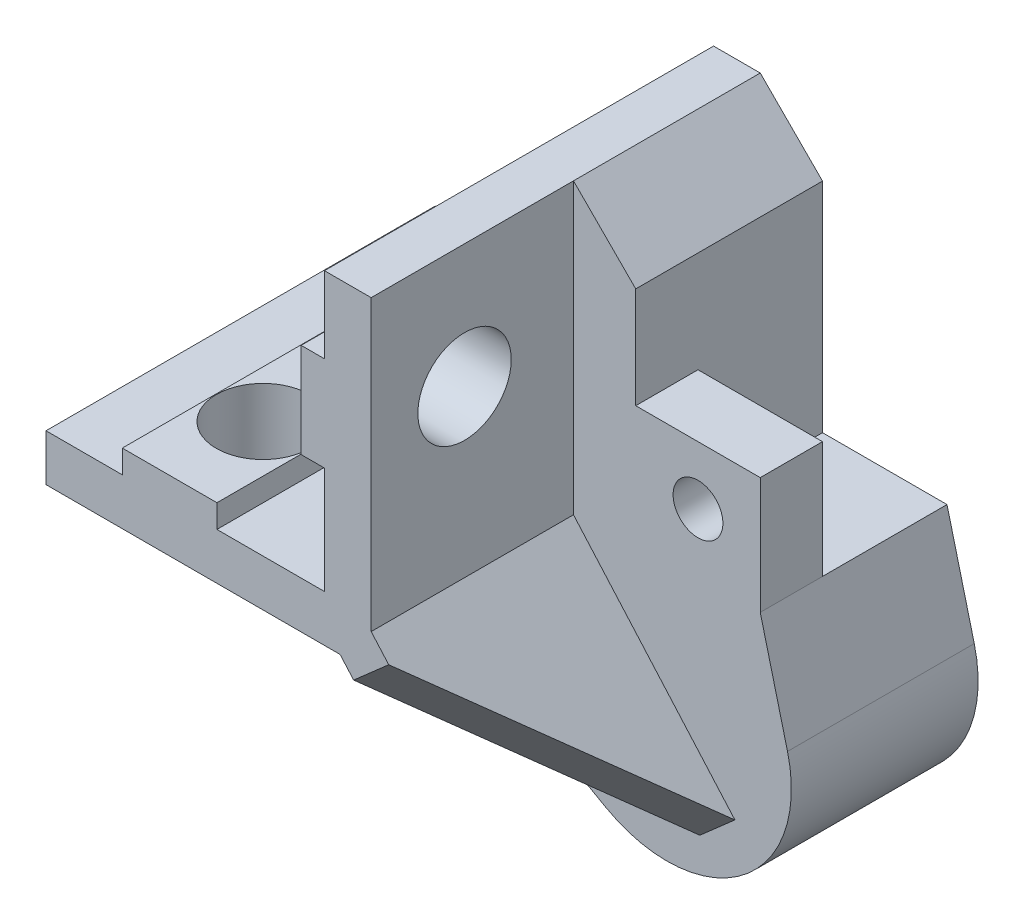
ISO-10303-21;
HEADER;
FILE_DESCRIPTION(('STEP AP214'),'2;1');
FILE_NAME('part.step','',(''),(''),'','','');
FILE_SCHEMA(('AUTOMOTIVE_DESIGN { 1 0 10303 214 1 1 1 1 }'));
ENDSEC;
DATA;
#1=APPLICATION_CONTEXT('core data for automotive mechanical design processes');
#2=APPLICATION_PROTOCOL_DEFINITION('international standard','automotive_design',2000,#1);
#3=PRODUCT_CONTEXT('',#1,'mechanical');
#4=PRODUCT('Part','Part','',(#3));
#5=PRODUCT_RELATED_PRODUCT_CATEGORY('part','',(#4));
#6=PRODUCT_DEFINITION_FORMATION('','',#4);
#7=PRODUCT_DEFINITION_CONTEXT('part definition',#1,'design');
#8=PRODUCT_DEFINITION('design','',#6,#7);
#9=PRODUCT_DEFINITION_SHAPE('','',#8);
#10=(LENGTH_UNIT() NAMED_UNIT(*) SI_UNIT(.MILLI.,.METRE.));
#11=(NAMED_UNIT(*) PLANE_ANGLE_UNIT() SI_UNIT($,.RADIAN.));
#12=(NAMED_UNIT(*) SI_UNIT($,.STERADIAN.) SOLID_ANGLE_UNIT());
#13=UNCERTAINTY_MEASURE_WITH_UNIT(LENGTH_MEASURE(1.E-05),#10,'distance_accuracy_value','');
#14=(GEOMETRIC_REPRESENTATION_CONTEXT(3) GLOBAL_UNCERTAINTY_ASSIGNED_CONTEXT((#13)) GLOBAL_UNIT_ASSIGNED_CONTEXT((#10,
#11,#12)) REPRESENTATION_CONTEXT('',''));
#15=CARTESIAN_POINT('',(0.,0.,0.));
#16=DIRECTION('',(0.,0.,1.));
#17=DIRECTION('',(1.,0.,0.));
#18=AXIS2_PLACEMENT_3D('',#15,#16,#17);
#19=CARTESIAN_POINT('',(234.088719843331,44.2696097209728,-13.));
#20=DIRECTION('',(0.,1.,0.));
#21=DIRECTION('',(0.,0.,1.));
#22=AXIS2_PLACEMENT_3D('',#19,#20,#21);
#23=PLANE('',#22);
#24=DIRECTION('',(0.,0.,-1.));
#25=VECTOR('',#24,1.);
#26=CARTESIAN_POINT('',(234.088719843331,44.2696097209728,-13.));
#27=LINE('',#26,#25);
#28=CARTESIAN_POINT('',(234.088719843331,44.2696097209728,-17.));
#29=VERTEX_POINT('',#28);
#30=CARTESIAN_POINT('',(234.088719843331,44.2696097209728,-25.));
#31=VERTEX_POINT('',#30);
#32=EDGE_CURVE('E308',#29,#31,#27,.T.);
#33=ORIENTED_EDGE('',*,*,#32,.F.);
#34=DIRECTION('',(1.,0.,0.));
#35=VECTOR('',#34,1.);
#36=CARTESIAN_POINT('',(242.088719843331,44.2696097209728,-17.));
#37=LINE('',#36,#35);
#38=CARTESIAN_POINT('',(242.088719843331,44.2696097209728,-17.));
#39=VERTEX_POINT('',#38);
#40=EDGE_CURVE('E47',#29,#39,#37,.T.);
#41=ORIENTED_EDGE('',*,*,#40,.T.);
#42=DIRECTION('',(0.,0.,-1.));
#43=VECTOR('',#42,1.);
#44=CARTESIAN_POINT('',(242.088719843331,44.2696097209728,-13.));
#45=LINE('',#44,#43);
#46=CARTESIAN_POINT('',(242.088719843331,44.2696097209728,-25.));
#47=VERTEX_POINT('',#46);
#48=EDGE_CURVE('E307',#39,#47,#45,.T.);
#49=ORIENTED_EDGE('',*,*,#48,.T.);
#50=DIRECTION('',(1.,0.,0.));
#51=VECTOR('',#50,1.);
#52=CARTESIAN_POINT('',(234.088719843331,44.2696097209728,-25.));
#53=LINE('',#52,#51);
#54=EDGE_CURVE('E290',#31,#47,#53,.T.);
#55=ORIENTED_EDGE('',*,*,#54,.F.);
#56=EDGE_LOOP('',(#33,#41,#49,#55));
#57=FACE_BOUND('',#56,.T.);
#58=ADVANCED_FACE('F32',(#57),#23,.T.);
#59=CARTESIAN_POINT('',(230.088719843331,41.429550862018,-25.));
#60=DIRECTION('',(1.,0.,0.));
#61=DIRECTION('',(0.,0.,-1.));
#62=AXIS2_PLACEMENT_3D('',#59,#60,#61);
#63=PLANE('',#62);
#64=CARTESIAN_POINT('',(230.088719843331,54.3395711724228,-6.));
#65=DIRECTION('',(1.,0.,0.));
#66=DIRECTION('',(0.,0.,-1.));
#67=AXIS2_PLACEMENT_3D('',#64,#65,#66);
#68=CIRCLE('',#67,3.);
#69=CARTESIAN_POINT('',(230.088719843331,54.3395711724228,-9.));
#70=VERTEX_POINT('',#69);
#71=EDGE_CURVE('E314',#70,#70,#68,.T.);
#72=ORIENTED_EDGE('',*,*,#71,.F.);
#73=EDGE_LOOP('',(#72));
#74=FACE_BOUND('',#73,.T.);
#75=DIRECTION('',(0.,1.,0.));
#76=VECTOR('',#75,1.);
#77=CARTESIAN_POINT('',(230.088719843331,41.429550862018,0.));
#78=LINE('',#77,#76);
#79=CARTESIAN_POINT('',(230.088719843331,43.7010200375261,0.));
#80=VERTEX_POINT('',#79);
#81=CARTESIAN_POINT('',(230.088719843331,62.2829711724228,0.));
#82=VERTEX_POINT('',#81);
#83=EDGE_CURVE('E322',#80,#82,#78,.T.);
#84=ORIENTED_EDGE('',*,*,#83,.F.);
#85=DIRECTION('',(0.,0.,-1.));
#86=VECTOR('',#85,1.);
#87=CARTESIAN_POINT('',(230.088719843331,43.7010200375261,-25.));
#88=LINE('',#87,#86);
#89=CARTESIAN_POINT('',(230.088719843331,43.7010200375261,-13.));
#90=VERTEX_POINT('',#89);
#91=EDGE_CURVE('E257',#80,#90,#88,.T.);
#92=ORIENTED_EDGE('',*,*,#91,.T.);
#93=DIRECTION('',(0.,1.,0.));
#94=VECTOR('',#93,1.);
#95=CARTESIAN_POINT('',(230.088719843331,41.429550862018,-13.));
#96=LINE('',#95,#94);
#97=CARTESIAN_POINT('',(230.088719843331,62.2829711724228,-13.));
#98=VERTEX_POINT('',#97);
#99=EDGE_CURVE('E264',#90,#98,#96,.T.);
#100=ORIENTED_EDGE('',*,*,#99,.T.);
#101=DIRECTION('',(0.,0.,1.));
#102=VECTOR('',#101,1.);
#103=CARTESIAN_POINT('',(230.088719843331,62.2829711724228,-25.));
#104=LINE('',#103,#102);
#105=EDGE_CURVE('E398',#98,#82,#104,.T.);
#106=ORIENTED_EDGE('',*,*,#105,.T.);
#107=EDGE_LOOP('',(#84,#92,#100,#106));
#108=FACE_BOUND('',#107,.T.);
#109=ADVANCED_FACE('F483',(#74,#108),#63,.T.);
#110=CARTESIAN_POINT('',(209.195275179556,41.429550862018,-25.));
#111=DIRECTION('',(0.,-1.,0.));
#112=DIRECTION('',(0.,0.,-1.));
#113=AXIS2_PLACEMENT_3D('',#110,#111,#112);
#114=PLANE('',#113);
#115=DIRECTION('',(0.,0.,-1.));
#116=VECTOR('',#115,1.);
#117=CARTESIAN_POINT('',(228.091234798935,41.429550862018,-25.));
#118=LINE('',#117,#116);
#119=CARTESIAN_POINT('',(228.091234798935,41.429550862018,0.));
#120=VERTEX_POINT('',#119);
#121=CARTESIAN_POINT('',(228.091234798935,41.429550862018,-13.));
#122=VERTEX_POINT('',#121);
#123=EDGE_CURVE('E260',#120,#122,#118,.T.);
#124=ORIENTED_EDGE('',*,*,#123,.F.);
#125=DIRECTION('',(1.,0.,0.));
#126=VECTOR('',#125,1.);
#127=CARTESIAN_POINT('',(209.195275179556,41.429550862018,0.));
#128=LINE('',#127,#126);
#129=CARTESIAN_POINT('',(209.195275179556,41.429550862018,0.));
#130=VERTEX_POINT('',#129);
#131=EDGE_CURVE('E391',#130,#120,#128,.T.);
#132=ORIENTED_EDGE('',*,*,#131,.F.);
#133=DIRECTION('',(0.,0.,1.));
#134=VECTOR('',#133,1.);
#135=CARTESIAN_POINT('',(209.195275179556,41.429550862018,-25.));
#136=LINE('',#135,#134);
#137=CARTESIAN_POINT('',(209.195275179556,41.429550862018,-13.));
#138=VERTEX_POINT('',#137);
#139=EDGE_CURVE('E402',#138,#130,#136,.T.);
#140=ORIENTED_EDGE('',*,*,#139,.F.);
#141=DIRECTION('',(1.,0.,0.));
#142=VECTOR('',#141,1.);
#143=CARTESIAN_POINT('',(209.195275179556,41.429550862018,-13.));
#144=LINE('',#143,#142);
#145=EDGE_CURVE('E281',#138,#122,#144,.T.);
#146=ORIENTED_EDGE('',*,*,#145,.T.);
#147=EDGE_LOOP('',(#124,#132,#140,#146));
#148=FACE_BOUND('',#147,.T.);
#149=CARTESIAN_POINT('',(217.138695007103,41.429550862018,-6.));
#150=DIRECTION('',(0.,-1.,0.));
#151=DIRECTION('',(0.,0.,-1.));
#152=AXIS2_PLACEMENT_3D('',#149,#150,#151);
#153=CIRCLE('',#152,2.99999999999999);
#154=CARTESIAN_POINT('',(217.138695007103,41.429550862018,-8.99999999999999));
#155=VERTEX_POINT('',#154);
#156=EDGE_CURVE('E303',#155,#155,#153,.T.);
#157=ORIENTED_EDGE('',*,*,#156,.F.);
#158=EDGE_LOOP('',(#157));
#159=FACE_BOUND('',#158,.T.);
#160=ADVANCED_FACE('F449',(#148,#159),#114,.T.);
#161=CARTESIAN_POINT('',(230.088719843331,62.2829711724228,-25.));
#162=DIRECTION('',(0.,1.,0.));
#163=DIRECTION('',(-1.,0.,0.));
#164=AXIS2_PLACEMENT_3D('',#161,#162,#163);
#165=PLANE('',#164);
#166=DIRECTION('',(-1.,0.,0.));
#167=VECTOR('',#166,1.);
#168=CARTESIAN_POINT('',(230.088719843331,62.2829711724228,0.));
#169=LINE('',#168,#167);
#170=CARTESIAN_POINT('',(227.088719843331,62.2829711724228,0.));
#171=VERTEX_POINT('',#170);
#172=EDGE_CURVE('E355',#82,#171,#169,.T.);
#173=ORIENTED_EDGE('',*,*,#172,.F.);
#174=ORIENTED_EDGE('',*,*,#105,.F.);
#175=CARTESIAN_POINT('',(230.088719843331,62.2829711724228,-25.));
#176=VERTEX_POINT('',#175);
#177=EDGE_CURVE('E395',#176,#98,#104,.T.);
#178=ORIENTED_EDGE('',*,*,#177,.F.);
#179=DIRECTION('',(-1.,0.,0.));
#180=VECTOR('',#179,1.);
#181=CARTESIAN_POINT('',(230.088719843331,62.2829711724228,-25.));
#182=LINE('',#181,#180);
#183=CARTESIAN_POINT('',(227.088719843331,62.2829711724228,-25.));
#184=VERTEX_POINT('',#183);
#185=EDGE_CURVE('E318',#176,#184,#182,.T.);
#186=ORIENTED_EDGE('',*,*,#185,.T.);
#187=DIRECTION('',(0.,0.,1.));
#188=VECTOR('',#187,1.);
#189=CARTESIAN_POINT('',(227.088719843331,62.2829711724228,-25.));
#190=LINE('',#189,#188);
#191=EDGE_CURVE('E354',#184,#171,#190,.T.);
#192=ORIENTED_EDGE('',*,*,#191,.T.);
#193=EDGE_LOOP('',(#173,#174,#178,#186,#192));
#194=FACE_BOUND('',#193,.T.);
#195=ADVANCED_FACE('F34',(#194),#165,.T.);
#196=CARTESIAN_POINT('',(209.195275179556,44.429550862018,-25.));
#197=DIRECTION('',(-1.,0.,0.));
#198=DIRECTION('',(0.,-1.,0.));
#199=AXIS2_PLACEMENT_3D('',#196,#197,#198);
#200=PLANE('',#199);
#201=DIRECTION('',(0.,-1.,0.));
#202=VECTOR('',#201,1.);
#203=CARTESIAN_POINT('',(209.195275179556,44.429550862018,0.));
#204=LINE('',#203,#202);
#205=CARTESIAN_POINT('',(209.195275179556,44.429550862018,0.));
#206=VERTEX_POINT('',#205);
#207=EDGE_CURVE('E388',#206,#130,#204,.T.);
#208=ORIENTED_EDGE('',*,*,#207,.F.);
#209=DIRECTION('',(0.,0.,1.));
#210=VECTOR('',#209,1.);
#211=CARTESIAN_POINT('',(209.195275179556,44.429550862018,-25.));
#212=LINE('',#211,#210);
#213=CARTESIAN_POINT('',(209.195275179556,44.429550862018,-25.));
#214=VERTEX_POINT('',#213);
#215=EDGE_CURVE('E403',#214,#206,#212,.T.);
#216=ORIENTED_EDGE('',*,*,#215,.F.);
#217=DIRECTION('',(0.,-1.,0.));
#218=VECTOR('',#217,1.);
#219=CARTESIAN_POINT('',(209.195275179556,44.429550862018,-25.));
#220=LINE('',#219,#218);
#221=CARTESIAN_POINT('',(209.195275179556,41.429550862018,-25.));
#222=VERTEX_POINT('',#221);
#223=EDGE_CURVE('E352',#214,#222,#220,.T.);
#224=ORIENTED_EDGE('',*,*,#223,.T.);
#225=EDGE_CURVE('E399',#222,#138,#136,.T.);
#226=ORIENTED_EDGE('',*,*,#225,.T.);
#227=ORIENTED_EDGE('',*,*,#139,.T.);
#228=EDGE_LOOP('',(#208,#216,#224,#226,#227));
#229=FACE_BOUND('',#228,.T.);
#230=ADVANCED_FACE('F497',(#229),#200,.T.);
#231=CARTESIAN_POINT('',(214.098687418949,44.429550862018,-25.));
#232=DIRECTION('',(0.,1.,0.));
#233=DIRECTION('',(-1.,0.,0.));
#234=AXIS2_PLACEMENT_3D('',#231,#232,#233);
#235=PLANE('',#234);
#236=DIRECTION('',(-1.,0.,0.));
#237=VECTOR('',#236,1.);
#238=CARTESIAN_POINT('',(214.098687418949,44.429550862018,0.));
#239=LINE('',#238,#237);
#240=CARTESIAN_POINT('',(214.098687418949,44.429550862018,0.));
#241=VERTEX_POINT('',#240);
#242=EDGE_CURVE('E385',#241,#206,#239,.T.);
#243=ORIENTED_EDGE('',*,*,#242,.F.);
#244=DIRECTION('',(0.,0.,1.));
#245=VECTOR('',#244,1.);
#246=CARTESIAN_POINT('',(214.098687418949,44.429550862018,-25.));
#247=LINE('',#246,#245);
#248=CARTESIAN_POINT('',(214.098687418949,44.429550862018,-25.));
#249=VERTEX_POINT('',#248);
#250=EDGE_CURVE('E405',#249,#241,#247,.T.);
#251=ORIENTED_EDGE('',*,*,#250,.F.);
#252=DIRECTION('',(-1.,0.,0.));
#253=VECTOR('',#252,1.);
#254=CARTESIAN_POINT('',(214.098687418949,44.429550862018,-25.));
#255=LINE('',#254,#253);
#256=EDGE_CURVE('E349',#249,#214,#255,.T.);
#257=ORIENTED_EDGE('',*,*,#256,.T.);
#258=ORIENTED_EDGE('',*,*,#215,.T.);
#259=EDGE_LOOP('',(#243,#251,#257,#258));
#260=FACE_BOUND('',#259,.T.);
#261=ADVANCED_FACE('F500',(#260),#235,.T.);
#262=CARTESIAN_POINT('',(214.098687418949,45.9171950677049,-25.));
#263=DIRECTION('',(-1.,0.,0.));
#264=DIRECTION('',(0.,0.,1.));
#265=AXIS2_PLACEMENT_3D('',#262,#263,#264);
#266=PLANE('',#265);
#267=DIRECTION('',(0.,-1.,0.));
#268=VECTOR('',#267,1.);
#269=CARTESIAN_POINT('',(214.098687418949,45.9171950677049,0.));
#270=LINE('',#269,#268);
#271=CARTESIAN_POINT('',(214.098687418949,45.9171950677049,0.));
#272=VERTEX_POINT('',#271);
#273=EDGE_CURVE('E382',#272,#241,#270,.T.);
#274=ORIENTED_EDGE('',*,*,#273,.F.);
#275=DIRECTION('',(0.,0.,1.));
#276=VECTOR('',#275,1.);
#277=CARTESIAN_POINT('',(214.098687418949,45.9171950677049,-25.));
#278=LINE('',#277,#276);
#279=CARTESIAN_POINT('',(214.098687418949,45.9171950677049,-25.));
#280=VERTEX_POINT('',#279);
#281=EDGE_CURVE('E407',#280,#272,#278,.T.);
#282=ORIENTED_EDGE('',*,*,#281,.F.);
#283=DIRECTION('',(0.,-1.,0.));
#284=VECTOR('',#283,1.);
#285=CARTESIAN_POINT('',(214.098687418949,45.9171950677049,-25.));
#286=LINE('',#285,#284);
#287=EDGE_CURVE('E346',#280,#249,#286,.T.);
#288=ORIENTED_EDGE('',*,*,#287,.T.);
#289=ORIENTED_EDGE('',*,*,#250,.T.);
#290=EDGE_LOOP('',(#274,#282,#288,#289));
#291=FACE_BOUND('',#290,.T.);
#292=ADVANCED_FACE('F504',(#291),#266,.T.);
#293=CARTESIAN_POINT('',(220.178702595257,45.9171950677049,-25.));
#294=DIRECTION('',(0.,1.,0.));
#295=DIRECTION('',(0.,0.,1.));
#296=AXIS2_PLACEMENT_3D('',#293,#294,#295);
#297=PLANE('',#296);
#298=CARTESIAN_POINT('',(217.138695007103,45.9171950677049,-6.));
#299=DIRECTION('',(0.,1.,0.));
#300=DIRECTION('',(0.,0.,1.));
#301=AXIS2_PLACEMENT_3D('',#298,#299,#300);
#302=CIRCLE('',#301,2.99999999999999);
#303=CARTESIAN_POINT('',(217.138695007103,45.9171950677049,-3.00000000000001));
#304=VERTEX_POINT('',#303);
#305=EDGE_CURVE('E313',#304,#304,#302,.T.);
#306=ORIENTED_EDGE('',*,*,#305,.F.);
#307=EDGE_LOOP('',(#306));
#308=FACE_BOUND('',#307,.T.);
#309=DIRECTION('',(-1.,0.,0.));
#310=VECTOR('',#309,1.);
#311=CARTESIAN_POINT('',(220.178702595257,45.9171950677049,0.));
#312=LINE('',#311,#310);
#313=CARTESIAN_POINT('',(220.178702595257,45.9171950677049,0.));
#314=VERTEX_POINT('',#313);
#315=EDGE_CURVE('E379',#314,#272,#312,.T.);
#316=ORIENTED_EDGE('',*,*,#315,.F.);
#317=DIRECTION('',(0.,0.,1.));
#318=VECTOR('',#317,1.);
#319=CARTESIAN_POINT('',(220.178702595257,45.9171950677049,-25.));
#320=LINE('',#319,#318);
#321=CARTESIAN_POINT('',(220.178702595257,45.9171950677049,-25.));
#322=VERTEX_POINT('',#321);
#323=EDGE_CURVE('E409',#322,#314,#320,.T.);
#324=ORIENTED_EDGE('',*,*,#323,.F.);
#325=DIRECTION('',(-1.,0.,0.));
#326=VECTOR('',#325,1.);
#327=CARTESIAN_POINT('',(220.178702595257,45.9171950677049,-25.));
#328=LINE('',#327,#326);
#329=EDGE_CURVE('E343',#322,#280,#328,.T.);
#330=ORIENTED_EDGE('',*,*,#329,.T.);
#331=ORIENTED_EDGE('',*,*,#281,.T.);
#332=EDGE_LOOP('',(#316,#324,#330,#331));
#333=FACE_BOUND('',#332,.T.);
#334=ADVANCED_FACE('F508',(#308,#333),#297,.T.);
#335=CARTESIAN_POINT('',(220.178702595257,45.9171950677049,-25.));
#336=DIRECTION('',(1.,0.,0.));
#337=DIRECTION('',(0.,1.,0.));
#338=AXIS2_PLACEMENT_3D('',#335,#336,#337);
#339=PLANE('',#338);
#340=DIRECTION('',(0.,1.,0.));
#341=VECTOR('',#340,1.);
#342=CARTESIAN_POINT('',(220.178702595257,45.9171950677049,0.));
#343=LINE('',#342,#341);
#344=CARTESIAN_POINT('',(220.178702595257,44.429550862018,0.));
#345=VERTEX_POINT('',#344);
#346=EDGE_CURVE('E376',#345,#314,#343,.T.);
#347=ORIENTED_EDGE('',*,*,#346,.F.);
#348=DIRECTION('',(0.,0.,1.));
#349=VECTOR('',#348,1.);
#350=CARTESIAN_POINT('',(220.178702595257,44.429550862018,-25.));
#351=LINE('',#350,#349);
#352=CARTESIAN_POINT('',(220.178702595257,44.429550862018,-25.));
#353=VERTEX_POINT('',#352);
#354=EDGE_CURVE('E411',#353,#345,#351,.T.);
#355=ORIENTED_EDGE('',*,*,#354,.F.);
#356=DIRECTION('',(0.,1.,0.));
#357=VECTOR('',#356,1.);
#358=CARTESIAN_POINT('',(220.178702595257,45.9171950677049,-25.));
#359=LINE('',#358,#357);
#360=EDGE_CURVE('E340',#353,#322,#359,.T.);
#361=ORIENTED_EDGE('',*,*,#360,.T.);
#362=ORIENTED_EDGE('',*,*,#323,.T.);
#363=EDGE_LOOP('',(#347,#355,#361,#362));
#364=FACE_BOUND('',#363,.T.);
#365=ADVANCED_FACE('F512',(#364),#339,.T.);
#366=CARTESIAN_POINT('',(227.088719843331,44.429550862018,-25.));
#367=DIRECTION('',(0.,1.,0.));
#368=DIRECTION('',(0.,0.,1.));
#369=AXIS2_PLACEMENT_3D('',#366,#367,#368);
#370=PLANE('',#369);
#371=DIRECTION('',(-1.,0.,0.));
#372=VECTOR('',#371,1.);
#373=CARTESIAN_POINT('',(227.088719843331,44.429550862018,0.));
#374=LINE('',#373,#372);
#375=CARTESIAN_POINT('',(227.088719843331,44.429550862018,0.));
#376=VERTEX_POINT('',#375);
#377=EDGE_CURVE('E373',#376,#345,#374,.T.);
#378=ORIENTED_EDGE('',*,*,#377,.F.);
#379=DIRECTION('',(0.,0.,1.));
#380=VECTOR('',#379,1.);
#381=CARTESIAN_POINT('',(227.088719843331,44.429550862018,-25.));
#382=LINE('',#381,#380);
#383=CARTESIAN_POINT('',(227.088719843331,44.429550862018,-25.));
#384=VERTEX_POINT('',#383);
#385=EDGE_CURVE('E413',#384,#376,#382,.T.);
#386=ORIENTED_EDGE('',*,*,#385,.F.);
#387=DIRECTION('',(-1.,0.,0.));
#388=VECTOR('',#387,1.);
#389=CARTESIAN_POINT('',(227.088719843331,44.429550862018,-25.));
#390=LINE('',#389,#388);
#391=EDGE_CURVE('E337',#384,#353,#390,.T.);
#392=ORIENTED_EDGE('',*,*,#391,.T.);
#393=ORIENTED_EDGE('',*,*,#354,.T.);
#394=EDGE_LOOP('',(#378,#386,#392,#393));
#395=FACE_BOUND('',#394,.T.);
#396=ADVANCED_FACE('F516',(#395),#370,.T.);
#397=CARTESIAN_POINT('',(227.088719843331,51.2995711724228,-25.));
#398=DIRECTION('',(-1.,0.,0.));
#399=DIRECTION('',(0.,0.,1.));
#400=AXIS2_PLACEMENT_3D('',#397,#398,#399);
#401=PLANE('',#400);
#402=DIRECTION('',(0.,-1.,0.));
#403=VECTOR('',#402,1.);
#404=CARTESIAN_POINT('',(227.088719843331,51.2995711724228,0.));
#405=LINE('',#404,#403);
#406=CARTESIAN_POINT('',(227.088719843331,51.2995711724228,0.));
#407=VERTEX_POINT('',#406);
#408=EDGE_CURVE('E370',#407,#376,#405,.T.);
#409=ORIENTED_EDGE('',*,*,#408,.F.);
#410=DIRECTION('',(0.,0.,1.));
#411=VECTOR('',#410,1.);
#412=CARTESIAN_POINT('',(227.088719843331,51.2995711724228,-25.));
#413=LINE('',#412,#411);
#414=CARTESIAN_POINT('',(227.088719843331,51.2995711724228,-25.));
#415=VERTEX_POINT('',#414);
#416=EDGE_CURVE('E415',#415,#407,#413,.T.);
#417=ORIENTED_EDGE('',*,*,#416,.F.);
#418=DIRECTION('',(0.,-1.,0.));
#419=VECTOR('',#418,1.);
#420=CARTESIAN_POINT('',(227.088719843331,51.2995711724228,-25.));
#421=LINE('',#420,#419);
#422=EDGE_CURVE('E334',#415,#384,#421,.T.);
#423=ORIENTED_EDGE('',*,*,#422,.T.);
#424=ORIENTED_EDGE('',*,*,#385,.T.);
#425=EDGE_LOOP('',(#409,#417,#423,#424));
#426=FACE_BOUND('',#425,.T.);
#427=ADVANCED_FACE('F520',(#426),#401,.T.);
#428=CARTESIAN_POINT('',(225.590119843331,51.2995711724228,-25.));
#429=DIRECTION('',(0.,-1.,0.));
#430=DIRECTION('',(0.,0.,-1.));
#431=AXIS2_PLACEMENT_3D('',#428,#429,#430);
#432=PLANE('',#431);
#433=DIRECTION('',(1.,0.,0.));
#434=VECTOR('',#433,1.);
#435=CARTESIAN_POINT('',(225.590119843331,51.2995711724228,0.));
#436=LINE('',#435,#434);
#437=CARTESIAN_POINT('',(225.590119843331,51.2995711724228,0.));
#438=VERTEX_POINT('',#437);
#439=EDGE_CURVE('E367',#438,#407,#436,.T.);
#440=ORIENTED_EDGE('',*,*,#439,.F.);
#441=DIRECTION('',(0.,0.,1.));
#442=VECTOR('',#441,1.);
#443=CARTESIAN_POINT('',(225.590119843331,51.2995711724228,-25.));
#444=LINE('',#443,#442);
#445=CARTESIAN_POINT('',(225.590119843331,51.2995711724228,-25.));
#446=VERTEX_POINT('',#445);
#447=EDGE_CURVE('E417',#446,#438,#444,.T.);
#448=ORIENTED_EDGE('',*,*,#447,.F.);
#449=DIRECTION('',(1.,0.,0.));
#450=VECTOR('',#449,1.);
#451=CARTESIAN_POINT('',(225.590119843331,51.2995711724228,-25.));
#452=LINE('',#451,#450);
#453=EDGE_CURVE('E331',#446,#415,#452,.T.);
#454=ORIENTED_EDGE('',*,*,#453,.T.);
#455=ORIENTED_EDGE('',*,*,#416,.T.);
#456=EDGE_LOOP('',(#440,#448,#454,#455));
#457=FACE_BOUND('',#456,.T.);
#458=ADVANCED_FACE('F524',(#457),#432,.T.);
#459=CARTESIAN_POINT('',(225.590119843331,51.2995711724228,-25.));
#460=DIRECTION('',(-1.,0.,0.));
#461=DIRECTION('',(0.,0.,1.));
#462=AXIS2_PLACEMENT_3D('',#459,#460,#461);
#463=PLANE('',#462);
#464=CARTESIAN_POINT('',(225.590119843331,54.3395711724228,-6.));
#465=DIRECTION('',(-1.,0.,0.));
#466=DIRECTION('',(0.,0.,1.));
#467=AXIS2_PLACEMENT_3D('',#464,#465,#466);
#468=CIRCLE('',#467,3.);
#469=CARTESIAN_POINT('',(225.590119843331,54.3395711724228,-3.));
#470=VERTEX_POINT('',#469);
#471=EDGE_CURVE('E317',#470,#470,#468,.T.);
#472=ORIENTED_EDGE('',*,*,#471,.F.);
#473=EDGE_LOOP('',(#472));
#474=FACE_BOUND('',#473,.T.);
#475=DIRECTION('',(0.,-1.,0.));
#476=VECTOR('',#475,1.);
#477=CARTESIAN_POINT('',(225.590119843331,51.2995711724228,0.));
#478=LINE('',#477,#476);
#479=CARTESIAN_POINT('',(225.590119843331,57.3795711724228,0.));
#480=VERTEX_POINT('',#479);
#481=EDGE_CURVE('E364',#480,#438,#478,.T.);
#482=ORIENTED_EDGE('',*,*,#481,.F.);
#483=DIRECTION('',(0.,0.,1.));
#484=VECTOR('',#483,1.);
#485=CARTESIAN_POINT('',(225.590119843331,57.3795711724228,-25.));
#486=LINE('',#485,#484);
#487=CARTESIAN_POINT('',(225.590119843331,57.3795711724228,-25.));
#488=VERTEX_POINT('',#487);
#489=EDGE_CURVE('E419',#488,#480,#486,.T.);
#490=ORIENTED_EDGE('',*,*,#489,.F.);
#491=DIRECTION('',(0.,-1.,0.));
#492=VECTOR('',#491,1.);
#493=CARTESIAN_POINT('',(225.590119843331,51.2995711724228,-25.));
#494=LINE('',#493,#492);
#495=EDGE_CURVE('E328',#488,#446,#494,.T.);
#496=ORIENTED_EDGE('',*,*,#495,.T.);
#497=ORIENTED_EDGE('',*,*,#447,.T.);
#498=EDGE_LOOP('',(#482,#490,#496,#497));
#499=FACE_BOUND('',#498,.T.);
#500=ADVANCED_FACE('F528',(#474,#499),#463,.T.);
#501=CARTESIAN_POINT('',(225.590119843331,57.3795711724228,-25.));
#502=DIRECTION('',(0.,1.,0.));
#503=DIRECTION('',(0.,0.,1.));
#504=AXIS2_PLACEMENT_3D('',#501,#502,#503);
#505=PLANE('',#504);
#506=DIRECTION('',(-1.,0.,0.));
#507=VECTOR('',#506,1.);
#508=CARTESIAN_POINT('',(225.590119843331,57.3795711724228,0.));
#509=LINE('',#508,#507);
#510=CARTESIAN_POINT('',(227.088719843331,57.3795711724228,0.));
#511=VERTEX_POINT('',#510);
#512=EDGE_CURVE('E361',#511,#480,#509,.T.);
#513=ORIENTED_EDGE('',*,*,#512,.F.);
#514=DIRECTION('',(0.,0.,1.));
#515=VECTOR('',#514,1.);
#516=CARTESIAN_POINT('',(227.088719843331,57.3795711724228,-25.));
#517=LINE('',#516,#515);
#518=CARTESIAN_POINT('',(227.088719843331,57.3795711724228,-25.));
#519=VERTEX_POINT('',#518);
#520=EDGE_CURVE('E421',#519,#511,#517,.T.);
#521=ORIENTED_EDGE('',*,*,#520,.F.);
#522=DIRECTION('',(-1.,0.,0.));
#523=VECTOR('',#522,1.);
#524=CARTESIAN_POINT('',(225.590119843331,57.3795711724228,-25.));
#525=LINE('',#524,#523);
#526=EDGE_CURVE('E325',#519,#488,#525,.T.);
#527=ORIENTED_EDGE('',*,*,#526,.T.);
#528=ORIENTED_EDGE('',*,*,#489,.T.);
#529=EDGE_LOOP('',(#513,#521,#527,#528));
#530=FACE_BOUND('',#529,.T.);
#531=ADVANCED_FACE('F532',(#530),#505,.T.);
#532=CARTESIAN_POINT('',(227.088719843331,62.2829711724228,-25.));
#533=DIRECTION('',(-1.,0.,0.));
#534=DIRECTION('',(0.,0.,1.));
#535=AXIS2_PLACEMENT_3D('',#532,#533,#534);
#536=PLANE('',#535);
#537=DIRECTION('',(0.,-1.,0.));
#538=VECTOR('',#537,1.);
#539=CARTESIAN_POINT('',(227.088719843331,62.2829711724228,0.));
#540=LINE('',#539,#538);
#541=EDGE_CURVE('E358',#171,#511,#540,.T.);
#542=ORIENTED_EDGE('',*,*,#541,.F.);
#543=ORIENTED_EDGE('',*,*,#191,.F.);
#544=DIRECTION('',(0.,-1.,0.));
#545=VECTOR('',#544,1.);
#546=CARTESIAN_POINT('',(227.088719843331,62.2829711724228,-25.));
#547=LINE('',#546,#545);
#548=EDGE_CURVE('E321',#184,#519,#547,.T.);
#549=ORIENTED_EDGE('',*,*,#548,.T.);
#550=ORIENTED_EDGE('',*,*,#520,.T.);
#551=EDGE_LOOP('',(#542,#543,#549,#550));
#552=FACE_BOUND('',#551,.T.);
#553=ADVANCED_FACE('F480',(#552),#536,.T.);
#554=CARTESIAN_POINT('',(227.088719843331,62.2829711724228,-25.));
#555=DIRECTION('',(0.,0.,1.));
#556=DIRECTION('',(1.,0.,0.));
#557=AXIS2_PLACEMENT_3D('',#554,#555,#556);
#558=PLANE('',#557);
#559=CARTESIAN_POINT('',(236.088719843331,35.429550862018,-25.));
#560=DIRECTION('',(0.,0.,-1.));
#561=DIRECTION('',(-1.,0.,0.));
#562=AXIS2_PLACEMENT_3D('',#559,#560,#561);
#563=CIRCLE('',#562,4.85);
#564=CARTESIAN_POINT('',(231.238719843331,35.429550862018,-25.));
#565=VERTEX_POINT('',#564);
#566=EDGE_CURVE('E233',#565,#565,#563,.T.);
#567=ORIENTED_EDGE('',*,*,#566,.F.);
#568=EDGE_LOOP('',(#567));
#569=FACE_BOUND('',#568,.T.);
#570=ORIENTED_EDGE('',*,*,#185,.F.);
#571=DIRECTION('',(0.70592677244828,-0.70828482402262,0.));
#572=VECTOR('',#571,1.);
#573=CARTESIAN_POINT('',(230.088719843331,62.2829711724228,-25.));
#574=LINE('',#573,#572);
#575=CARTESIAN_POINT('',(234.088719843331,58.2696097209728,-25.));
#576=VERTEX_POINT('',#575);
#577=EDGE_CURVE('E263',#176,#576,#574,.T.);
#578=ORIENTED_EDGE('',*,*,#577,.T.);
#579=DIRECTION('',(0.,-1.,0.));
#580=VECTOR('',#579,1.);
#581=CARTESIAN_POINT('',(234.088719843331,58.2696097209728,-25.));
#582=LINE('',#581,#580);
#583=EDGE_CURVE('E287',#576,#31,#582,.T.);
#584=ORIENTED_EDGE('',*,*,#583,.T.);
#585=ORIENTED_EDGE('',*,*,#54,.T.);
#586=DIRECTION('',(0.247330057577153,-0.968931288904885,0.));
#587=VECTOR('',#586,1.);
#588=CARTESIAN_POINT('',(242.088719843331,44.2696097209728,-25.));
#589=LINE('',#588,#587);
#590=CARTESIAN_POINT('',(243.84017015457,37.4081913226352,-25.));
#591=VERTEX_POINT('',#590);
#592=EDGE_CURVE('E293',#47,#591,#589,.T.);
#593=ORIENTED_EDGE('',*,*,#592,.T.);
#594=CARTESIAN_POINT('',(236.088719843331,35.429550862018,-25.));
#595=DIRECTION('',(0.,0.,-1.));
#596=DIRECTION('',(-1.,0.,0.));
#597=AXIS2_PLACEMENT_3D('',#594,#595,#596);
#598=CIRCLE('',#597,8.);
#599=CARTESIAN_POINT('',(232.154834184776,28.4635948166917,-25.));
#600=VERTEX_POINT('',#599);
#601=EDGE_CURVE('E296',#591,#600,#598,.T.);
#602=ORIENTED_EDGE('',*,*,#601,.T.);
#603=DIRECTION('',(-0.870744505665787,0.491735707319333,0.));
#604=VECTOR('',#603,1.);
#605=CARTESIAN_POINT('',(232.154834184776,28.4635948166917,-25.));
#606=LINE('',#605,#604);
#607=EDGE_CURVE('E267',#600,#222,#606,.T.);
#608=ORIENTED_EDGE('',*,*,#607,.T.);
#609=ORIENTED_EDGE('',*,*,#223,.F.);
#610=ORIENTED_EDGE('',*,*,#256,.F.);
#611=ORIENTED_EDGE('',*,*,#287,.F.);
#612=ORIENTED_EDGE('',*,*,#329,.F.);
#613=ORIENTED_EDGE('',*,*,#360,.F.);
#614=ORIENTED_EDGE('',*,*,#391,.F.);
#615=ORIENTED_EDGE('',*,*,#422,.F.);
#616=ORIENTED_EDGE('',*,*,#453,.F.);
#617=ORIENTED_EDGE('',*,*,#495,.F.);
#618=ORIENTED_EDGE('',*,*,#526,.F.);
#619=ORIENTED_EDGE('',*,*,#548,.F.);
#620=EDGE_LOOP('',(#570,#578,#584,#585,#593,#602,#608,#609,#610,#611,#612,#613,#614,#615,#616,
#617,#618,#619));
#621=FACE_BOUND('',#620,.T.);
#622=ADVANCED_FACE('F475',(#569,#621),#558,.F.);
#623=CARTESIAN_POINT('',(227.088719843331,62.2829711724228,0.));
#624=DIRECTION('',(0.,0.,1.));
#625=DIRECTION('',(1.,0.,0.));
#626=AXIS2_PLACEMENT_3D('',#623,#624,#625);
#627=PLANE('',#626);
#628=ORIENTED_EDGE('',*,*,#408,.T.);
#629=ORIENTED_EDGE('',*,*,#377,.T.);
#630=ORIENTED_EDGE('',*,*,#346,.T.);
#631=ORIENTED_EDGE('',*,*,#315,.T.);
#632=ORIENTED_EDGE('',*,*,#273,.T.);
#633=ORIENTED_EDGE('',*,*,#242,.T.);
#634=ORIENTED_EDGE('',*,*,#207,.T.);
#635=ORIENTED_EDGE('',*,*,#131,.T.);
#636=DIRECTION('',(-0.660365553789403,0.750944295782593,0.));
#637=VECTOR('',#636,1.);
#638=CARTESIAN_POINT('',(228.962303399657,40.4390025313338,0.));
#639=LINE('',#638,#637);
#640=CARTESIAN_POINT('',(228.962303399657,40.4390025313338,0.));
#641=VERTEX_POINT('',#640);
#642=EDGE_CURVE('E241',#641,#120,#639,.T.);
#643=ORIENTED_EDGE('',*,*,#642,.F.);
#644=DIRECTION('',(0.750944295782593,0.660365553789403,0.));
#645=VECTOR('',#644,1.);
#646=CARTESIAN_POINT('',(228.962303399657,40.4390025313338,0.));
#647=LINE('',#646,#645);
#648=CARTESIAN_POINT('',(231.215136287005,42.4200991927021,0.));
#649=VERTEX_POINT('',#648);
#650=EDGE_CURVE('E248',#641,#649,#647,.T.);
#651=ORIENTED_EDGE('',*,*,#650,.T.);
#652=DIRECTION('',(-0.660365553789403,0.750944295782593,0.));
#653=VECTOR('',#652,1.);
#654=CARTESIAN_POINT('',(231.215136287005,42.4200991927021,0.));
#655=LINE('',#654,#653);
#656=EDGE_CURVE('E238',#649,#80,#655,.T.);
#657=ORIENTED_EDGE('',*,*,#656,.T.);
#658=ORIENTED_EDGE('',*,*,#83,.T.);
#659=ORIENTED_EDGE('',*,*,#172,.T.);
#660=ORIENTED_EDGE('',*,*,#541,.T.);
#661=ORIENTED_EDGE('',*,*,#512,.T.);
#662=ORIENTED_EDGE('',*,*,#481,.T.);
#663=ORIENTED_EDGE('',*,*,#439,.T.);
#664=EDGE_LOOP('',(#628,#629,#630,#631,#632,#633,#634,#635,#643,#651,#657,#658,#659,#660,#661,
#662,#663));
#665=FACE_BOUND('',#664,.T.);
#666=ADVANCED_FACE('F445',(#665),#627,.T.);
#667=CARTESIAN_POINT('',(215.088719843331,54.3395711724228,-6.));
#668=DIRECTION('',(1.,0.,0.));
#669=DIRECTION('',(0.,0.,-1.));
#670=AXIS2_PLACEMENT_3D('',#667,#668,#669);
#671=CYLINDRICAL_SURFACE('',#670,3.);
#672=ORIENTED_EDGE('',*,*,#471,.T.);
#673=EDGE_LOOP('',(#672));
#674=FACE_BOUND('',#673,.T.);
#675=ORIENTED_EDGE('',*,*,#71,.T.);
#676=EDGE_LOOP('',(#675));
#677=FACE_BOUND('',#676,.T.);
#678=ADVANCED_FACE('F544',(#674,#677),#671,.F.);
#679=CARTESIAN_POINT('',(217.138695007103,56.429550862018,-6.));
#680=DIRECTION('',(0.,-1.,0.));
#681=DIRECTION('',(0.,0.,-1.));
#682=AXIS2_PLACEMENT_3D('',#679,#680,#681);
#683=CYLINDRICAL_SURFACE('',#682,2.99999999999999);
#684=ORIENTED_EDGE('',*,*,#305,.T.);
#685=EDGE_LOOP('',(#684));
#686=FACE_BOUND('',#685,.T.);
#687=ORIENTED_EDGE('',*,*,#156,.T.);
#688=EDGE_LOOP('',(#687));
#689=FACE_BOUND('',#688,.T.);
#690=ADVANCED_FACE('F549',(#686,#689),#683,.F.);
#691=CARTESIAN_POINT('',(232.154834184776,28.4635948166917,-13.));
#692=DIRECTION('',(-0.491735707319333,-0.870744505665787,0.));
#693=DIRECTION('',(0.870744505665787,-0.491735707319333,0.));
#694=AXIS2_PLACEMENT_3D('',#691,#692,#693);
#695=PLANE('',#694);
#696=ORIENTED_EDGE('',*,*,#607,.F.);
#697=DIRECTION('',(0.,0.,-1.));
#698=VECTOR('',#697,1.);
#699=CARTESIAN_POINT('',(232.154834184776,28.4635948166917,-13.));
#700=LINE('',#699,#698);
#701=CARTESIAN_POINT('',(232.154834184776,28.4635948166917,-13.));
#702=VERTEX_POINT('',#701);
#703=EDGE_CURVE('E301',#702,#600,#700,.T.);
#704=ORIENTED_EDGE('',*,*,#703,.F.);
#705=DIRECTION('',(-0.870744505665787,0.491735707319333,0.));
#706=VECTOR('',#705,1.);
#707=CARTESIAN_POINT('',(232.154834184776,28.4635948166917,-13.));
#708=LINE('',#707,#706);
#709=EDGE_CURVE('E278',#702,#138,#708,.T.);
#710=ORIENTED_EDGE('',*,*,#709,.T.);
#711=ORIENTED_EDGE('',*,*,#225,.F.);
#712=EDGE_LOOP('',(#696,#704,#710,#711));
#713=FACE_BOUND('',#712,.T.);
#714=ADVANCED_FACE('F553',(#713),#695,.T.);
#715=CARTESIAN_POINT('',(236.088719843331,35.429550862018,-13.));
#716=DIRECTION('',(0.,0.,-1.));
#717=DIRECTION('',(-1.,0.,0.));
#718=AXIS2_PLACEMENT_3D('',#715,#716,#717);
#719=CYLINDRICAL_SURFACE('',#718,8.);
#720=ORIENTED_EDGE('',*,*,#601,.F.);
#721=DIRECTION('',(0.,0.,-1.));
#722=VECTOR('',#721,1.);
#723=CARTESIAN_POINT('',(243.84017015457,37.4081913226352,-13.));
#724=LINE('',#723,#722);
#725=CARTESIAN_POINT('',(243.84017015457,37.4081913226352,-13.));
#726=VERTEX_POINT('',#725);
#727=EDGE_CURVE('E304',#726,#591,#724,.T.);
#728=ORIENTED_EDGE('',*,*,#727,.F.);
#729=CARTESIAN_POINT('',(236.088719843331,35.429550862018,-13.));
#730=DIRECTION('',(0.,0.,-1.));
#731=DIRECTION('',(-1.,0.,0.));
#732=AXIS2_PLACEMENT_3D('',#729,#730,#731);
#733=CIRCLE('',#732,8.);
#734=EDGE_CURVE('E275',#726,#702,#733,.T.);
#735=ORIENTED_EDGE('',*,*,#734,.T.);
#736=ORIENTED_EDGE('',*,*,#703,.T.);
#737=EDGE_LOOP('',(#720,#728,#735,#736));
#738=FACE_BOUND('',#737,.T.);
#739=ADVANCED_FACE('F458',(#738),#719,.T.);
#740=CARTESIAN_POINT('',(242.088719843331,44.2696097209728,-13.));
#741=DIRECTION('',(0.968931288904885,0.247330057577153,0.));
#742=DIRECTION('',(-0.247330057577153,0.968931288904885,0.));
#743=AXIS2_PLACEMENT_3D('',#740,#741,#742);
#744=PLANE('',#743);
#745=ORIENTED_EDGE('',*,*,#592,.F.);
#746=ORIENTED_EDGE('',*,*,#48,.F.);
#747=CARTESIAN_POINT('',(242.088719843331,44.2696097209728,-13.));
#748=VERTEX_POINT('',#747);
#749=EDGE_CURVE('E221',#748,#39,#45,.T.);
#750=ORIENTED_EDGE('',*,*,#749,.F.);
#751=DIRECTION('',(0.247330057577153,-0.968931288904885,0.));
#752=VECTOR('',#751,1.);
#753=CARTESIAN_POINT('',(242.088719843331,44.2696097209728,-13.));
#754=LINE('',#753,#752);
#755=EDGE_CURVE('E272',#748,#726,#754,.T.);
#756=ORIENTED_EDGE('',*,*,#755,.T.);
#757=ORIENTED_EDGE('',*,*,#727,.T.);
#758=EDGE_LOOP('',(#745,#746,#750,#756,#757));
#759=FACE_BOUND('',#758,.T.);
#760=ADVANCED_FACE('F462',(#759),#744,.T.);
#761=CARTESIAN_POINT('',(234.088719843331,58.2696097209728,-13.));
#762=DIRECTION('',(1.,0.,0.));
#763=DIRECTION('',(0.,0.,-1.));
#764=AXIS2_PLACEMENT_3D('',#761,#762,#763);
#765=PLANE('',#764);
#766=DIRECTION('',(0.,0.,1.));
#767=VECTOR('',#766,1.);
#768=CARTESIAN_POINT('',(234.088719843331,51.7696097209728,-17.));
#769=LINE('',#768,#767);
#770=CARTESIAN_POINT('',(234.088719843331,51.7696097209728,-17.));
#771=VERTEX_POINT('',#770);
#772=CARTESIAN_POINT('',(234.088719843331,51.7696097209728,-13.));
#773=VERTEX_POINT('',#772);
#774=EDGE_CURVE('E55',#771,#773,#769,.T.);
#775=ORIENTED_EDGE('',*,*,#774,.F.);
#776=DIRECTION('',(0.,-1.,0.));
#777=VECTOR('',#776,1.);
#778=CARTESIAN_POINT('',(234.088719843331,44.2696097209728,-17.));
#779=LINE('',#778,#777);
#780=EDGE_CURVE('E217',#771,#29,#779,.T.);
#781=ORIENTED_EDGE('',*,*,#780,.T.);
#782=ORIENTED_EDGE('',*,*,#32,.T.);
#783=ORIENTED_EDGE('',*,*,#583,.F.);
#784=DIRECTION('',(0.,0.,-1.));
#785=VECTOR('',#784,1.);
#786=CARTESIAN_POINT('',(234.088719843331,58.2696097209728,-13.));
#787=LINE('',#786,#785);
#788=CARTESIAN_POINT('',(234.088719843331,58.2696097209728,-13.));
#789=VERTEX_POINT('',#788);
#790=EDGE_CURVE('E284',#789,#576,#787,.T.);
#791=ORIENTED_EDGE('',*,*,#790,.F.);
#792=DIRECTION('',(0.,-1.,0.));
#793=VECTOR('',#792,1.);
#794=CARTESIAN_POINT('',(234.088719843331,58.2696097209728,-13.));
#795=LINE('',#794,#793);
#796=EDGE_CURVE('E270',#789,#773,#795,.T.);
#797=ORIENTED_EDGE('',*,*,#796,.T.);
#798=EDGE_LOOP('',(#775,#781,#782,#783,#791,#797));
#799=FACE_BOUND('',#798,.T.);
#800=ADVANCED_FACE('F557',(#799),#765,.T.);
#801=CARTESIAN_POINT('',(230.088719843331,62.2829711724228,-13.));
#802=DIRECTION('',(0.70828482402262,0.70592677244828,0.));
#803=DIRECTION('',(-0.70592677244828,0.70828482402262,0.));
#804=AXIS2_PLACEMENT_3D('',#801,#802,#803);
#805=PLANE('',#804);
#806=ORIENTED_EDGE('',*,*,#577,.F.);
#807=ORIENTED_EDGE('',*,*,#177,.T.);
#808=DIRECTION('',(0.70592677244828,-0.70828482402262,0.));
#809=VECTOR('',#808,1.);
#810=CARTESIAN_POINT('',(230.088719843331,62.2829711724228,-13.));
#811=LINE('',#810,#809);
#812=EDGE_CURVE('E266',#98,#789,#811,.T.);
#813=ORIENTED_EDGE('',*,*,#812,.T.);
#814=ORIENTED_EDGE('',*,*,#790,.T.);
#815=EDGE_LOOP('',(#806,#807,#813,#814));
#816=FACE_BOUND('',#815,.T.);
#817=ADVANCED_FACE('F466',(#816),#805,.T.);
#818=CARTESIAN_POINT('',(236.088719843331,35.429550862018,-13.));
#819=DIRECTION('',(0.,0.,-1.));
#820=DIRECTION('',(-1.,0.,0.));
#821=AXIS2_PLACEMENT_3D('',#818,#819,#820);
#822=PLANE('',#821);
#823=CARTESIAN_POINT('',(238.088719843331,48.0196097209728,-13.));
#824=DIRECTION('',(0.,0.,1.));
#825=DIRECTION('',(1.,0.,0.));
#826=AXIS2_PLACEMENT_3D('',#823,#824,#825);
#827=CIRCLE('',#826,1.59999999999999);
#828=CARTESIAN_POINT('',(239.688719843331,48.0196097209728,-13.));
#829=VERTEX_POINT('',#828);
#830=EDGE_CURVE('E226',#829,#829,#827,.T.);
#831=ORIENTED_EDGE('',*,*,#830,.F.);
#832=EDGE_LOOP('',(#831));
#833=FACE_BOUND('',#832,.T.);
#834=ORIENTED_EDGE('',*,*,#755,.F.);
#835=DIRECTION('',(0.,1.,0.));
#836=VECTOR('',#835,1.);
#837=CARTESIAN_POINT('',(242.088719843331,44.2696097209728,-13.));
#838=LINE('',#837,#836);
#839=CARTESIAN_POINT('',(242.088719843331,51.7696097209728,-13.));
#840=VERTEX_POINT('',#839);
#841=EDGE_CURVE('E223',#748,#840,#838,.T.);
#842=ORIENTED_EDGE('',*,*,#841,.T.);
#843=DIRECTION('',(-1.,0.,0.));
#844=VECTOR('',#843,1.);
#845=CARTESIAN_POINT('',(242.088719843331,51.7696097209728,-13.));
#846=LINE('',#845,#844);
#847=EDGE_CURVE('E207',#840,#773,#846,.T.);
#848=ORIENTED_EDGE('',*,*,#847,.T.);
#849=ORIENTED_EDGE('',*,*,#796,.F.);
#850=ORIENTED_EDGE('',*,*,#812,.F.);
#851=ORIENTED_EDGE('',*,*,#99,.F.);
#852=DIRECTION('',(-0.660365553789403,0.750944295782593,0.));
#853=VECTOR('',#852,1.);
#854=CARTESIAN_POINT('',(236.807018749291,36.0612087059948,-13.));
#855=LINE('',#854,#853);
#856=CARTESIAN_POINT('',(240.460254040056,31.9068790517458,-13.));
#857=VERTEX_POINT('',#856);
#858=EDGE_CURVE('E40',#857,#90,#855,.T.);
#859=ORIENTED_EDGE('',*,*,#858,.F.);
#860=DIRECTION('',(0.750944295782593,0.660365553789403,0.));
#861=VECTOR('',#860,1.);
#862=CARTESIAN_POINT('',(238.207421152709,29.9257823903775,-13.));
#863=LINE('',#862,#861);
#864=CARTESIAN_POINT('',(238.207421152709,29.9257823903775,-13.));
#865=VERTEX_POINT('',#864);
#866=EDGE_CURVE('E254',#865,#857,#863,.T.);
#867=ORIENTED_EDGE('',*,*,#866,.F.);
#868=DIRECTION('',(-0.660365553789403,0.750944295782593,0.));
#869=VECTOR('',#868,1.);
#870=CARTESIAN_POINT('',(234.554185861943,34.0801120446266,-13.));
#871=LINE('',#870,#869);
#872=EDGE_CURVE('E11',#865,#122,#871,.T.);
#873=ORIENTED_EDGE('',*,*,#872,.T.);
#874=ORIENTED_EDGE('',*,*,#145,.F.);
#875=ORIENTED_EDGE('',*,*,#709,.F.);
#876=ORIENTED_EDGE('',*,*,#734,.F.);
#877=EDGE_LOOP('',(#834,#842,#848,#849,#850,#851,#859,#867,#873,#874,#875,#876));
#878=FACE_BOUND('',#877,.T.);
#879=ADVANCED_FACE('F435',(#833,#878),#822,.F.);
#880=CARTESIAN_POINT('',(238.207421152709,29.9257823903775,-13.));
#881=DIRECTION('',(-0.449346467060281,0.510980871628852,-0.732793491626299));
#882=DIRECTION('',(0.,0.82026896518605,0.571977993241529));
#883=AXIS2_PLACEMENT_3D('',#880,#881,#882);
#884=PLANE('',#883);
#885=DIRECTION('',(-0.483911579911071,0.550287092523379,0.680451099367278));
#886=VECTOR('',#885,1.);
#887=CARTESIAN_POINT('',(240.460254040056,31.9068790517458,-13.));
#888=LINE('',#887,#886);
#889=EDGE_CURVE('E245',#857,#649,#888,.T.);
#890=ORIENTED_EDGE('',*,*,#889,.T.);
#891=ORIENTED_EDGE('',*,*,#650,.F.);
#892=DIRECTION('',(-0.483911579911071,0.550287092523379,0.680451099367278));
#893=VECTOR('',#892,1.);
#894=CARTESIAN_POINT('',(238.207421152709,29.9257823903775,-13.));
#895=LINE('',#894,#893);
#896=EDGE_CURVE('E244',#865,#641,#895,.T.);
#897=ORIENTED_EDGE('',*,*,#896,.F.);
#898=ORIENTED_EDGE('',*,*,#866,.T.);
#899=EDGE_LOOP('',(#890,#891,#897,#898));
#900=FACE_BOUND('',#899,.T.);
#901=ADVANCED_FACE('F440',(#900),#884,.F.);
#902=CARTESIAN_POINT('',(226.166362168514,43.6184477746875,0.));
#903=DIRECTION('',(-0.750944295782593,-0.660365553789403,0.));
#904=DIRECTION('',(0.660365553789403,-0.750944295782593,0.));
#905=AXIS2_PLACEMENT_3D('',#902,#903,#904);
#906=PLANE('',#905);
#907=ORIENTED_EDGE('',*,*,#642,.T.);
#908=ORIENTED_EDGE('',*,*,#123,.T.);
#909=ORIENTED_EDGE('',*,*,#872,.F.);
#910=ORIENTED_EDGE('',*,*,#896,.T.);
#911=EDGE_LOOP('',(#907,#908,#909,#910));
#912=FACE_BOUND('',#911,.T.);
#913=ADVANCED_FACE('F443',(#912),#906,.T.);
#914=CARTESIAN_POINT('',(228.419195055862,45.5995444360557,0.));
#915=DIRECTION('',(-0.750944295782593,-0.660365553789403,0.));
#916=DIRECTION('',(0.660365553789403,-0.750944295782593,0.));
#917=AXIS2_PLACEMENT_3D('',#914,#915,#916);
#918=PLANE('',#917);
#919=ORIENTED_EDGE('',*,*,#91,.F.);
#920=ORIENTED_EDGE('',*,*,#656,.F.);
#921=ORIENTED_EDGE('',*,*,#889,.F.);
#922=ORIENTED_EDGE('',*,*,#858,.T.);
#923=EDGE_LOOP('',(#919,#920,#921,#922));
#924=FACE_BOUND('',#923,.T.);
#925=ADVANCED_FACE('F431',(#924),#918,.F.);
#926=CARTESIAN_POINT('',(236.088719843331,35.429550862018,-16.));
#927=DIRECTION('',(0.,0.,-1.));
#928=DIRECTION('',(-1.,0.,0.));
#929=AXIS2_PLACEMENT_3D('',#926,#927,#928);
#930=CYLINDRICAL_SURFACE('',#929,4.85);
#931=CARTESIAN_POINT('',(236.088719843331,35.429550862018,-16.));
#932=DIRECTION('',(0.,0.,-1.));
#933=DIRECTION('',(-1.,0.,0.));
#934=AXIS2_PLACEMENT_3D('',#931,#932,#933);
#935=CIRCLE('',#934,4.85);
#936=CARTESIAN_POINT('',(231.238719843331,35.429550862018,-16.));
#937=VERTEX_POINT('',#936);
#938=EDGE_CURVE('E235',#937,#937,#935,.T.);
#939=ORIENTED_EDGE('',*,*,#938,.F.);
#940=EDGE_LOOP('',(#939));
#941=FACE_BOUND('',#940,.T.);
#942=ORIENTED_EDGE('',*,*,#566,.T.);
#943=EDGE_LOOP('',(#942));
#944=FACE_BOUND('',#943,.T.);
#945=ADVANCED_FACE('F573',(#941,#944),#930,.F.);
#946=CARTESIAN_POINT('',(236.088719843331,35.429550862018,-16.));
#947=DIRECTION('',(0.,0.,-1.));
#948=DIRECTION('',(-1.,0.,0.));
#949=AXIS2_PLACEMENT_3D('',#946,#947,#948);
#950=PLANE('',#949);
#951=ORIENTED_EDGE('',*,*,#938,.T.);
#952=EDGE_LOOP('',(#951));
#953=FACE_BOUND('',#952,.T.);
#954=ADVANCED_FACE('F578',(#953),#950,.T.);
#955=CARTESIAN_POINT('',(242.088719843331,44.2696097209728,-17.));
#956=DIRECTION('',(1.,0.,0.));
#957=DIRECTION('',(0.,0.,-1.));
#958=AXIS2_PLACEMENT_3D('',#955,#956,#957);
#959=PLANE('',#958);
#960=ORIENTED_EDGE('',*,*,#841,.F.);
#961=ORIENTED_EDGE('',*,*,#749,.T.);
#962=DIRECTION('',(0.,1.,0.));
#963=VECTOR('',#962,1.);
#964=CARTESIAN_POINT('',(242.088719843331,44.2696097209728,-17.));
#965=LINE('',#964,#963);
#966=CARTESIAN_POINT('',(242.088719843331,51.7696097209728,-17.));
#967=VERTEX_POINT('',#966);
#968=EDGE_CURVE('E216',#39,#967,#965,.T.);
#969=ORIENTED_EDGE('',*,*,#968,.T.);
#970=DIRECTION('',(0.,0.,1.));
#971=VECTOR('',#970,1.);
#972=CARTESIAN_POINT('',(242.088719843331,51.7696097209728,-17.));
#973=LINE('',#972,#971);
#974=EDGE_CURVE('E202',#967,#840,#973,.T.);
#975=ORIENTED_EDGE('',*,*,#974,.T.);
#976=EDGE_LOOP('',(#960,#961,#969,#975));
#977=FACE_BOUND('',#976,.T.);
#978=ADVANCED_FACE('F220',(#977),#959,.T.);
#979=CARTESIAN_POINT('',(242.088719843331,51.7696097209728,-17.));
#980=DIRECTION('',(0.,1.,0.));
#981=DIRECTION('',(0.,0.,1.));
#982=AXIS2_PLACEMENT_3D('',#979,#980,#981);
#983=PLANE('',#982);
#984=ORIENTED_EDGE('',*,*,#847,.F.);
#985=ORIENTED_EDGE('',*,*,#974,.F.);
#986=DIRECTION('',(-1.,0.,0.));
#987=VECTOR('',#986,1.);
#988=CARTESIAN_POINT('',(242.088719843331,51.7696097209728,-17.));
#989=LINE('',#988,#987);
#990=EDGE_CURVE('E205',#967,#771,#989,.T.);
#991=ORIENTED_EDGE('',*,*,#990,.T.);
#992=ORIENTED_EDGE('',*,*,#774,.T.);
#993=EDGE_LOOP('',(#984,#985,#991,#992));
#994=FACE_BOUND('',#993,.T.);
#995=ADVANCED_FACE('F204',(#994),#983,.T.);
#996=CARTESIAN_POINT('',(242.088719843331,51.7696097209728,-17.));
#997=DIRECTION('',(0.,0.,1.));
#998=DIRECTION('',(1.,0.,0.));
#999=AXIS2_PLACEMENT_3D('',#996,#997,#998);
#1000=PLANE('',#999);
#1001=CARTESIAN_POINT('',(238.088719843331,48.0196097209728,-17.));
#1002=DIRECTION('',(0.,0.,1.));
#1003=DIRECTION('',(1.,0.,0.));
#1004=AXIS2_PLACEMENT_3D('',#1001,#1002,#1003);
#1005=CIRCLE('',#1004,1.59999999999999);
#1006=CARTESIAN_POINT('',(239.688719843331,48.0196097209728,-17.));
#1007=VERTEX_POINT('',#1006);
#1008=EDGE_CURVE('E231',#1007,#1007,#1005,.T.);
#1009=ORIENTED_EDGE('',*,*,#1008,.T.);
#1010=EDGE_LOOP('',(#1009));
#1011=FACE_BOUND('',#1010,.T.);
#1012=ORIENTED_EDGE('',*,*,#968,.F.);
#1013=ORIENTED_EDGE('',*,*,#40,.F.);
#1014=ORIENTED_EDGE('',*,*,#780,.F.);
#1015=ORIENTED_EDGE('',*,*,#990,.F.);
#1016=EDGE_LOOP('',(#1012,#1013,#1014,#1015));
#1017=FACE_BOUND('',#1016,.T.);
#1018=ADVANCED_FACE('F215',(#1011,#1017),#1000,.F.);
#1019=CARTESIAN_POINT('',(238.088719843331,48.0196097209728,-17.));
#1020=DIRECTION('',(0.,0.,1.));
#1021=DIRECTION('',(1.,0.,0.));
#1022=AXIS2_PLACEMENT_3D('',#1019,#1020,#1021);
#1023=CYLINDRICAL_SURFACE('',#1022,1.59999999999999);
#1024=ORIENTED_EDGE('',*,*,#1008,.F.);
#1025=EDGE_LOOP('',(#1024));
#1026=FACE_BOUND('',#1025,.T.);
#1027=ORIENTED_EDGE('',*,*,#830,.T.);
#1028=EDGE_LOOP('',(#1027));
#1029=FACE_BOUND('',#1028,.T.);
#1030=ADVANCED_FACE('F589',(#1026,#1029),#1023,.F.);
#1031=CLOSED_SHELL('',(#58,#109,#160,#195,#230,#261,#292,#334,#365,#396,#427,#458,#500,#531,
#553,#622,#666,#678,#690,#714,#739,#760,#800,#817,#879,#901,#913,#925,#945,#954,#978,#995,#1018,#1030));
#1032=MANIFOLD_SOLID_BREP('B2',#1031);
#1033=ADVANCED_BREP_SHAPE_REPRESENTATION('',(#18,#1032),#14);
#1034=SHAPE_DEFINITION_REPRESENTATION(#9,#1033);
ENDSEC;
END-ISO-10303-21;
